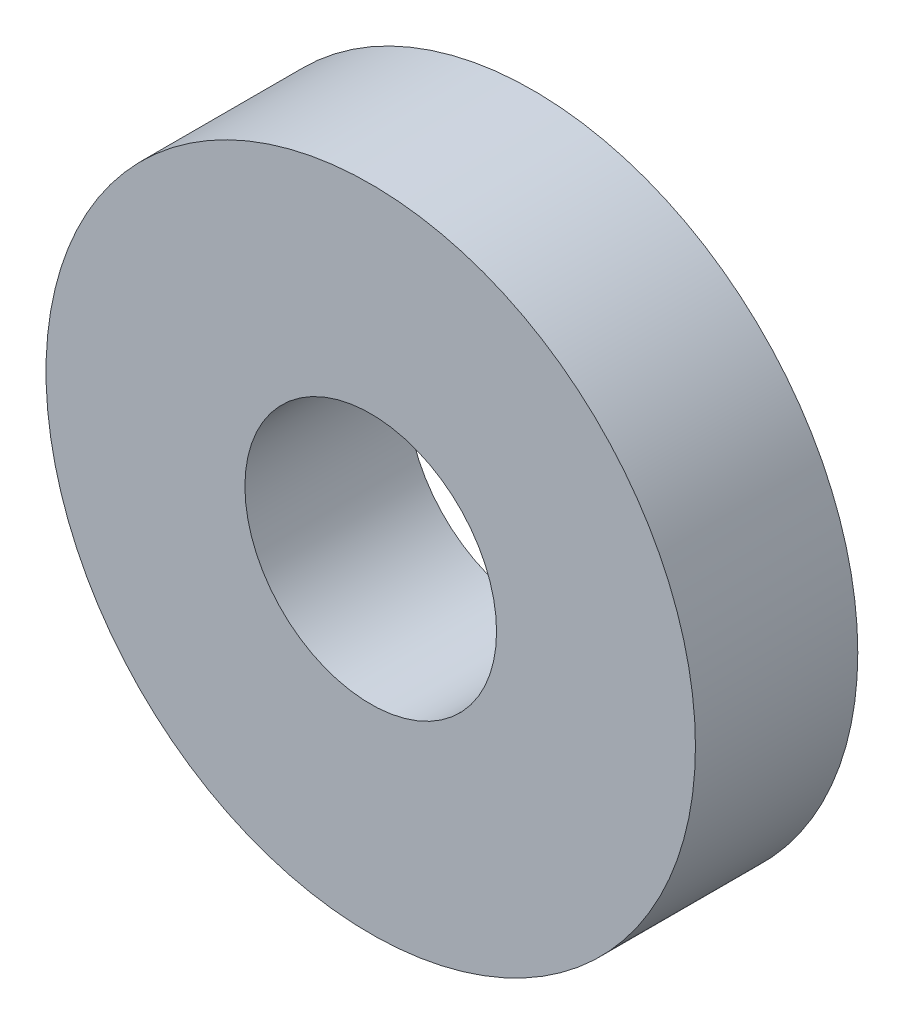
ISO-10303-21;
HEADER;
FILE_DESCRIPTION(('STEP AP214'),'2;1');
FILE_NAME('part.step','',(''),(''),'','','');
FILE_SCHEMA(('AUTOMOTIVE_DESIGN { 1 0 10303 214 1 1 1 1 }'));
ENDSEC;
DATA;
#1=APPLICATION_CONTEXT('core data for automotive mechanical design processes');
#2=APPLICATION_PROTOCOL_DEFINITION('international standard','automotive_design',2000,#1);
#3=PRODUCT_CONTEXT('',#1,'mechanical');
#4=PRODUCT('Part','Part','',(#3));
#5=PRODUCT_RELATED_PRODUCT_CATEGORY('part','',(#4));
#6=PRODUCT_DEFINITION_FORMATION('','',#4);
#7=PRODUCT_DEFINITION_CONTEXT('part definition',#1,'design');
#8=PRODUCT_DEFINITION('design','',#6,#7);
#9=PRODUCT_DEFINITION_SHAPE('','',#8);
#10=(LENGTH_UNIT() NAMED_UNIT(*) SI_UNIT(.MILLI.,.METRE.));
#11=(NAMED_UNIT(*) PLANE_ANGLE_UNIT() SI_UNIT($,.RADIAN.));
#12=(NAMED_UNIT(*) SI_UNIT($,.STERADIAN.) SOLID_ANGLE_UNIT());
#13=UNCERTAINTY_MEASURE_WITH_UNIT(LENGTH_MEASURE(1.E-05),#10,'distance_accuracy_value','');
#14=(GEOMETRIC_REPRESENTATION_CONTEXT(3) GLOBAL_UNCERTAINTY_ASSIGNED_CONTEXT((#13)) GLOBAL_UNIT_ASSIGNED_CONTEXT((#10,
#11,#12)) REPRESENTATION_CONTEXT('',''));
#15=CARTESIAN_POINT('',(0.,0.,0.));
#16=DIRECTION('',(0.,0.,1.));
#17=DIRECTION('',(1.,0.,0.));
#18=AXIS2_PLACEMENT_3D('',#15,#16,#17);
#19=CARTESIAN_POINT('',(0.,0.,2.));
#20=DIRECTION('',(0.,0.,-1.));
#21=DIRECTION('',(-1.,0.,0.));
#22=AXIS2_PLACEMENT_3D('',#19,#20,#21);
#23=CYLINDRICAL_SURFACE('',#22,4.);
#24=CARTESIAN_POINT('',(0.,0.,2.));
#25=DIRECTION('',(0.,0.,1.));
#26=DIRECTION('',(1.,0.,0.));
#27=AXIS2_PLACEMENT_3D('',#24,#25,#26);
#28=CIRCLE('',#27,4.);
#29=CARTESIAN_POINT('',(4.,0.,2.));
#30=VERTEX_POINT('',#29);
#31=EDGE_CURVE('E10',#30,#30,#28,.T.);
#32=ORIENTED_EDGE('',*,*,#31,.F.);
#33=EDGE_LOOP('',(#32));
#34=FACE_BOUND('',#33,.T.);
#35=CARTESIAN_POINT('',(0.,0.,0.));
#36=DIRECTION('',(0.,0.,1.));
#37=DIRECTION('',(1.,0.,0.));
#38=AXIS2_PLACEMENT_3D('',#35,#36,#37);
#39=CIRCLE('',#38,4.);
#40=CARTESIAN_POINT('',(4.,0.,0.));
#41=VERTEX_POINT('',#40);
#42=EDGE_CURVE('E40',#41,#41,#39,.T.);
#43=ORIENTED_EDGE('',*,*,#42,.T.);
#44=EDGE_LOOP('',(#43));
#45=FACE_BOUND('',#44,.T.);
#46=ADVANCED_FACE('F37',(#34,#45),#23,.T.);
#47=CARTESIAN_POINT('',(0.,0.,2.));
#48=DIRECTION('',(0.,0.,1.));
#49=DIRECTION('',(1.,0.,0.));
#50=AXIS2_PLACEMENT_3D('',#47,#48,#49);
#51=PLANE('',#50);
#52=CARTESIAN_POINT('',(0.,0.,2.));
#53=DIRECTION('',(0.,0.,1.));
#54=DIRECTION('',(1.,0.,0.));
#55=AXIS2_PLACEMENT_3D('',#52,#53,#54);
#56=CIRCLE('',#55,1.54999999999999);
#57=CARTESIAN_POINT('',(1.54999999999999,0.,2.));
#58=VERTEX_POINT('',#57);
#59=EDGE_CURVE('E51',#58,#58,#56,.T.);
#60=ORIENTED_EDGE('',*,*,#59,.F.);
#61=EDGE_LOOP('',(#60));
#62=FACE_BOUND('',#61,.T.);
#63=ORIENTED_EDGE('',*,*,#31,.T.);
#64=EDGE_LOOP('',(#63));
#65=FACE_BOUND('',#64,.T.);
#66=ADVANCED_FACE('F57',(#62,#65),#51,.T.);
#67=CARTESIAN_POINT('',(0.,0.,0.));
#68=DIRECTION('',(0.,0.,1.));
#69=DIRECTION('',(1.,0.,0.));
#70=AXIS2_PLACEMENT_3D('',#67,#68,#69);
#71=PLANE('',#70);
#72=CARTESIAN_POINT('',(0.,0.,0.));
#73=DIRECTION('',(0.,0.,1.));
#74=DIRECTION('',(1.,0.,0.));
#75=AXIS2_PLACEMENT_3D('',#72,#73,#74);
#76=CIRCLE('',#75,1.54999999999999);
#77=CARTESIAN_POINT('',(1.54999999999999,0.,0.));
#78=VERTEX_POINT('',#77);
#79=EDGE_CURVE('E47',#78,#78,#76,.T.);
#80=ORIENTED_EDGE('',*,*,#79,.T.);
#81=EDGE_LOOP('',(#80));
#82=FACE_BOUND('',#81,.T.);
#83=ORIENTED_EDGE('',*,*,#42,.F.);
#84=EDGE_LOOP('',(#83));
#85=FACE_BOUND('',#84,.T.);
#86=ADVANCED_FACE('F59',(#82,#85),#71,.F.);
#87=CARTESIAN_POINT('',(0.,0.,2.));
#88=DIRECTION('',(0.,0.,1.));
#89=DIRECTION('',(1.,0.,0.));
#90=AXIS2_PLACEMENT_3D('',#87,#88,#89);
#91=CYLINDRICAL_SURFACE('',#90,1.54999999999999);
#92=ORIENTED_EDGE('',*,*,#79,.F.);
#93=EDGE_LOOP('',(#92));
#94=FACE_BOUND('',#93,.T.);
#95=ORIENTED_EDGE('',*,*,#59,.T.);
#96=EDGE_LOOP('',(#95));
#97=FACE_BOUND('',#96,.T.);
#98=ADVANCED_FACE('F55',(#94,#97),#91,.F.);
#99=CLOSED_SHELL('',(#46,#66,#86,#98));
#100=MANIFOLD_SOLID_BREP('B2',#99);
#101=ADVANCED_BREP_SHAPE_REPRESENTATION('',(#18,#100),#14);
#102=SHAPE_DEFINITION_REPRESENTATION(#9,#101);
ENDSEC;
END-ISO-10303-21;
